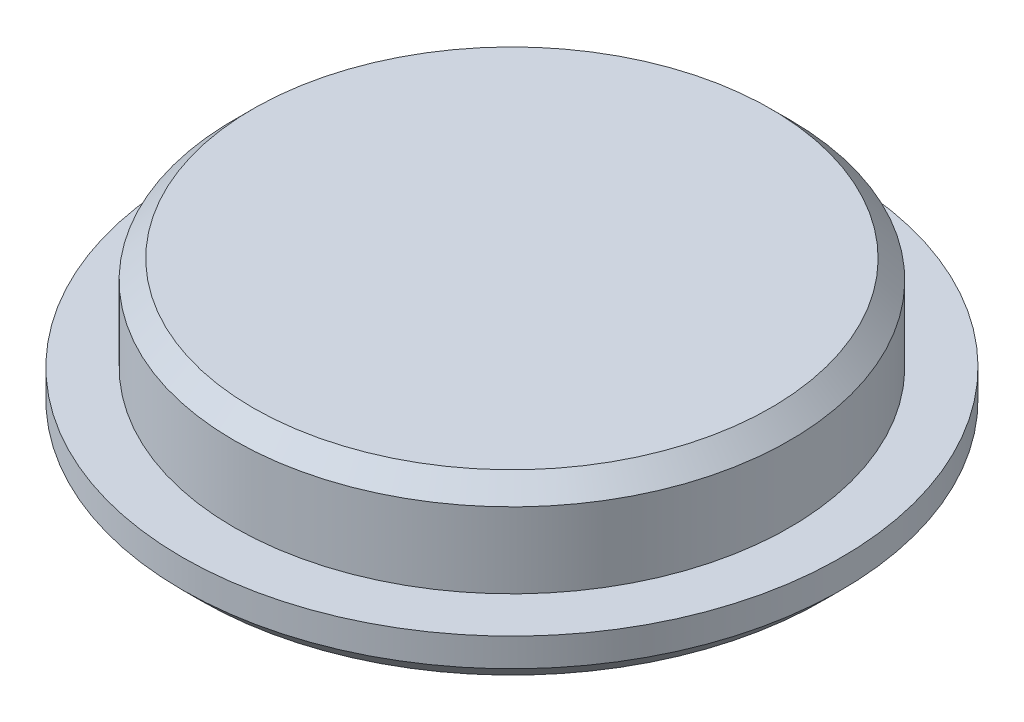
ISO-10303-21;
HEADER;
FILE_DESCRIPTION(('STEP AP214'),'2;1');
FILE_NAME('part.step','',(''),(''),'','','');
FILE_SCHEMA(('AUTOMOTIVE_DESIGN { 1 0 10303 214 1 1 1 1 }'));
ENDSEC;
DATA;
#1=APPLICATION_CONTEXT('core data for automotive mechanical design processes');
#2=APPLICATION_PROTOCOL_DEFINITION('international standard','automotive_design',2000,#1);
#3=PRODUCT_CONTEXT('',#1,'mechanical');
#4=PRODUCT('Part','Part','',(#3));
#5=PRODUCT_RELATED_PRODUCT_CATEGORY('part','',(#4));
#6=PRODUCT_DEFINITION_FORMATION('','',#4);
#7=PRODUCT_DEFINITION_CONTEXT('part definition',#1,'design');
#8=PRODUCT_DEFINITION('design','',#6,#7);
#9=PRODUCT_DEFINITION_SHAPE('','',#8);
#10=(LENGTH_UNIT() NAMED_UNIT(*) SI_UNIT(.MILLI.,.METRE.));
#11=(NAMED_UNIT(*) PLANE_ANGLE_UNIT() SI_UNIT($,.RADIAN.));
#12=(NAMED_UNIT(*) SI_UNIT($,.STERADIAN.) SOLID_ANGLE_UNIT());
#13=UNCERTAINTY_MEASURE_WITH_UNIT(LENGTH_MEASURE(1.E-05),#10,'distance_accuracy_value','');
#14=(GEOMETRIC_REPRESENTATION_CONTEXT(3) GLOBAL_UNCERTAINTY_ASSIGNED_CONTEXT((#13)) GLOBAL_UNIT_ASSIGNED_CONTEXT((#10,
#11,#12)) REPRESENTATION_CONTEXT('',''));
#15=CARTESIAN_POINT('',(0.,0.,0.));
#16=DIRECTION('',(0.,0.,1.));
#17=DIRECTION('',(1.,0.,0.));
#18=AXIS2_PLACEMENT_3D('',#15,#16,#17);
#19=CARTESIAN_POINT('',(0.,0.,0.));
#20=DIRECTION('',(0.,1.,0.));
#21=DIRECTION('',(0.,0.,1.));
#22=AXIS2_PLACEMENT_3D('',#19,#20,#21);
#23=PLANE('',#22);
#24=CARTESIAN_POINT('',(0.,0.,0.));
#25=DIRECTION('',(0.,1.,0.));
#26=DIRECTION('',(0.,0.,1.));
#27=AXIS2_PLACEMENT_3D('',#24,#25,#26);
#28=CIRCLE('',#27,33.);
#29=CARTESIAN_POINT('',(0.,0.,33.));
#30=VERTEX_POINT('',#29);
#31=EDGE_CURVE('E10',#30,#30,#28,.T.);
#32=ORIENTED_EDGE('',*,*,#31,.F.);
#33=EDGE_LOOP('',(#32));
#34=FACE_BOUND('',#33,.T.);
#35=ADVANCED_FACE('F37',(#34),#23,.F.);
#36=CARTESIAN_POINT('',(0.,0.,0.));
#37=DIRECTION('',(0.,1.,0.));
#38=DIRECTION('',(0.,0.,1.));
#39=AXIS2_PLACEMENT_3D('',#36,#37,#38);
#40=CONICAL_SURFACE('',#39,33.,0.785398163397449);
#41=CARTESIAN_POINT('',(0.,2.,0.));
#42=DIRECTION('',(0.,1.,0.));
#43=DIRECTION('',(0.,0.,1.));
#44=AXIS2_PLACEMENT_3D('',#41,#42,#43);
#45=CIRCLE('',#44,35.);
#46=CARTESIAN_POINT('',(0.,2.,35.));
#47=VERTEX_POINT('',#46);
#48=EDGE_CURVE('E44',#47,#47,#45,.T.);
#49=ORIENTED_EDGE('',*,*,#48,.F.);
#50=EDGE_LOOP('',(#49));
#51=FACE_BOUND('',#50,.T.);
#52=ORIENTED_EDGE('',*,*,#31,.T.);
#53=EDGE_LOOP('',(#52));
#54=FACE_BOUND('',#53,.T.);
#55=ADVANCED_FACE('F91',(#51,#54),#40,.T.);
#56=CARTESIAN_POINT('',(0.,0.,0.));
#57=DIRECTION('',(0.,1.,0.));
#58=DIRECTION('',(0.,0.,1.));
#59=AXIS2_PLACEMENT_3D('',#56,#57,#58);
#60=CYLINDRICAL_SURFACE('',#59,35.);
#61=CARTESIAN_POINT('',(0.,5.,0.));
#62=DIRECTION('',(0.,1.,0.));
#63=DIRECTION('',(0.,0.,1.));
#64=AXIS2_PLACEMENT_3D('',#61,#62,#63);
#65=CIRCLE('',#64,35.);
#66=CARTESIAN_POINT('',(0.,5.,35.));
#67=VERTEX_POINT('',#66);
#68=EDGE_CURVE('E49',#67,#67,#65,.T.);
#69=ORIENTED_EDGE('',*,*,#68,.F.);
#70=EDGE_LOOP('',(#69));
#71=FACE_BOUND('',#70,.T.);
#72=ORIENTED_EDGE('',*,*,#48,.T.);
#73=EDGE_LOOP('',(#72));
#74=FACE_BOUND('',#73,.T.);
#75=ADVANCED_FACE('F86',(#71,#74),#60,.T.);
#76=CARTESIAN_POINT('',(29.5,4.99999999999886,0.));
#77=DIRECTION('',(0.,-1.,0.));
#78=DIRECTION('',(0.,0.,-1.));
#79=AXIS2_PLACEMENT_3D('',#76,#77,#78);
#80=PLANE('',#79);
#81=CARTESIAN_POINT('',(0.,4.99999999999773,0.));
#82=DIRECTION('',(0.,1.,0.));
#83=DIRECTION('',(0.,0.,1.));
#84=AXIS2_PLACEMENT_3D('',#81,#82,#83);
#85=CIRCLE('',#84,29.5);
#86=CARTESIAN_POINT('',(0.,4.99999999999773,29.5));
#87=VERTEX_POINT('',#86);
#88=EDGE_CURVE('E54',#87,#87,#85,.T.);
#89=ORIENTED_EDGE('',*,*,#88,.F.);
#90=EDGE_LOOP('',(#89));
#91=FACE_BOUND('',#90,.T.);
#92=ORIENTED_EDGE('',*,*,#68,.T.);
#93=EDGE_LOOP('',(#92));
#94=FACE_BOUND('',#93,.T.);
#95=ADVANCED_FACE('F80',(#91,#94),#80,.F.);
#96=CARTESIAN_POINT('',(0.,0.,0.));
#97=DIRECTION('',(0.,1.,0.));
#98=DIRECTION('',(0.,0.,1.));
#99=AXIS2_PLACEMENT_3D('',#96,#97,#98);
#100=CYLINDRICAL_SURFACE('',#99,29.5);
#101=CARTESIAN_POINT('',(0.,13.,0.));
#102=DIRECTION('',(0.,1.,0.));
#103=DIRECTION('',(0.,0.,1.));
#104=AXIS2_PLACEMENT_3D('',#101,#102,#103);
#105=CIRCLE('',#104,29.5);
#106=CARTESIAN_POINT('',(0.,13.,29.5));
#107=VERTEX_POINT('',#106);
#108=EDGE_CURVE('E60',#107,#107,#105,.T.);
#109=ORIENTED_EDGE('',*,*,#108,.F.);
#110=EDGE_LOOP('',(#109));
#111=FACE_BOUND('',#110,.T.);
#112=ORIENTED_EDGE('',*,*,#88,.T.);
#113=EDGE_LOOP('',(#112));
#114=FACE_BOUND('',#113,.T.);
#115=ADVANCED_FACE('F74',(#111,#114),#100,.T.);
#116=CARTESIAN_POINT('',(0.,13.,0.));
#117=DIRECTION('',(0.,-1.,0.));
#118=DIRECTION('',(0.,0.,-1.));
#119=AXIS2_PLACEMENT_3D('',#116,#117,#118);
#120=CONICAL_SURFACE('',#119,29.5,0.785398163397565);
#121=CARTESIAN_POINT('',(0.,14.9999999999995,0.));
#122=DIRECTION('',(0.,1.,0.));
#123=DIRECTION('',(0.,0.,1.));
#124=AXIS2_PLACEMENT_3D('',#121,#122,#123);
#125=CIRCLE('',#124,27.5);
#126=CARTESIAN_POINT('',(0.,14.9999999999995,27.5));
#127=VERTEX_POINT('',#126);
#128=EDGE_CURVE('E64',#127,#127,#125,.T.);
#129=ORIENTED_EDGE('',*,*,#128,.F.);
#130=EDGE_LOOP('',(#129));
#131=FACE_BOUND('',#130,.T.);
#132=ORIENTED_EDGE('',*,*,#108,.T.);
#133=EDGE_LOOP('',(#132));
#134=FACE_BOUND('',#133,.T.);
#135=ADVANCED_FACE('F71',(#131,#134),#120,.T.);
#136=CARTESIAN_POINT('',(27.5,14.9999999999964,0.));
#137=DIRECTION('',(0.,-1.,0.));
#138=DIRECTION('',(0.,0.,-1.));
#139=AXIS2_PLACEMENT_3D('',#136,#137,#138);
#140=PLANE('',#139);
#141=ORIENTED_EDGE('',*,*,#128,.T.);
#142=EDGE_LOOP('',(#141));
#143=FACE_BOUND('',#142,.T.);
#144=ADVANCED_FACE('F69',(#143),#140,.F.);
#145=CLOSED_SHELL('',(#35,#55,#75,#95,#115,#135,#144));
#146=MANIFOLD_SOLID_BREP('B2',#145);
#147=ADVANCED_BREP_SHAPE_REPRESENTATION('',(#18,#146),#14);
#148=SHAPE_DEFINITION_REPRESENTATION(#9,#147);
ENDSEC;
END-ISO-10303-21;
